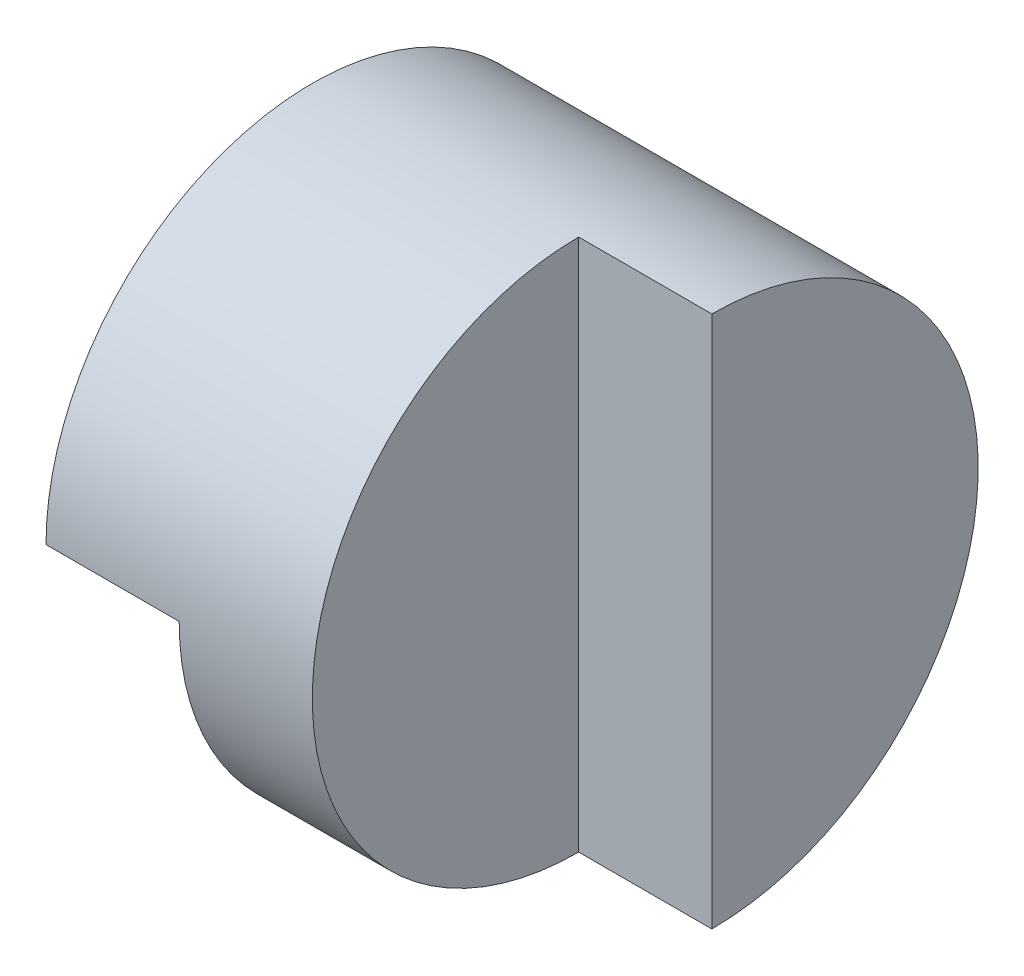
ISO-10303-21;
HEADER;
FILE_DESCRIPTION(('STEP AP214'),'2;1');
FILE_NAME('part.step','',(''),(''),'','','');
FILE_SCHEMA(('AUTOMOTIVE_DESIGN { 1 0 10303 214 1 1 1 1 }'));
ENDSEC;
DATA;
#1=APPLICATION_CONTEXT('core data for automotive mechanical design processes');
#2=APPLICATION_PROTOCOL_DEFINITION('international standard','automotive_design',2000,#1);
#3=PRODUCT_CONTEXT('',#1,'mechanical');
#4=PRODUCT('Part','Part','',(#3));
#5=PRODUCT_RELATED_PRODUCT_CATEGORY('part','',(#4));
#6=PRODUCT_DEFINITION_FORMATION('','',#4);
#7=PRODUCT_DEFINITION_CONTEXT('part definition',#1,'design');
#8=PRODUCT_DEFINITION('design','',#6,#7);
#9=PRODUCT_DEFINITION_SHAPE('','',#8);
#10=(LENGTH_UNIT() NAMED_UNIT(*) SI_UNIT(.MILLI.,.METRE.));
#11=(NAMED_UNIT(*) PLANE_ANGLE_UNIT() SI_UNIT($,.RADIAN.));
#12=(NAMED_UNIT(*) SI_UNIT($,.STERADIAN.) SOLID_ANGLE_UNIT());
#13=UNCERTAINTY_MEASURE_WITH_UNIT(LENGTH_MEASURE(1.E-05),#10,'distance_accuracy_value','');
#14=(GEOMETRIC_REPRESENTATION_CONTEXT(3) GLOBAL_UNCERTAINTY_ASSIGNED_CONTEXT((#13)) GLOBAL_UNIT_ASSIGNED_CONTEXT((#10,
#11,#12)) REPRESENTATION_CONTEXT('',''));
#15=CARTESIAN_POINT('',(0.,0.,0.));
#16=DIRECTION('',(0.,0.,1.));
#17=DIRECTION('',(1.,0.,0.));
#18=AXIS2_PLACEMENT_3D('',#15,#16,#17);
#19=CARTESIAN_POINT('',(40.,0.,40.));
#20=DIRECTION('',(-1.,0.,0.));
#21=DIRECTION('',(0.,0.,1.));
#22=AXIS2_PLACEMENT_3D('',#19,#20,#21);
#23=PLANE('',#22);
#24=CARTESIAN_POINT('',(40.,20.,20.));
#25=DIRECTION('',(-1.,0.,0.));
#26=DIRECTION('',(0.,0.,1.));
#27=AXIS2_PLACEMENT_3D('',#24,#25,#26);
#28=CIRCLE('',#27,20.);
#29=CARTESIAN_POINT('',(40.,40.,20.));
#30=VERTEX_POINT('',#29);
#31=CARTESIAN_POINT('',(40.,0.,20.));
#32=VERTEX_POINT('',#31);
#33=EDGE_CURVE('E142',#30,#32,#28,.T.);
#34=ORIENTED_EDGE('',*,*,#33,.F.);
#35=DIRECTION('',(0.,1.,0.));
#36=VECTOR('',#35,1.);
#37=CARTESIAN_POINT('',(40.,40.,20.));
#38=LINE('',#37,#36);
#39=EDGE_CURVE('E130',#32,#30,#38,.T.);
#40=ORIENTED_EDGE('',*,*,#39,.F.);
#41=EDGE_LOOP('',(#34,#40));
#42=FACE_BOUND('',#41,.T.);
#43=ADVANCED_FACE('F69',(#42),#23,.F.);
#44=CARTESIAN_POINT('',(10.,40.,0.));
#45=DIRECTION('',(1.,0.,0.));
#46=DIRECTION('',(0.,1.,0.));
#47=AXIS2_PLACEMENT_3D('',#44,#45,#46);
#48=PLANE('',#47);
#49=CARTESIAN_POINT('',(10.,20.,20.));
#50=DIRECTION('',(-1.,0.,0.));
#51=DIRECTION('',(0.,-1.,0.));
#52=AXIS2_PLACEMENT_3D('',#49,#50,#51);
#53=CIRCLE('',#52,20.);
#54=CARTESIAN_POINT('',(10.,20.,40.));
#55=VERTEX_POINT('',#54);
#56=CARTESIAN_POINT('',(10.,20.,0.));
#57=VERTEX_POINT('',#56);
#58=EDGE_CURVE('E168',#55,#57,#53,.T.);
#59=ORIENTED_EDGE('',*,*,#58,.T.);
#60=DIRECTION('',(0.,0.,1.));
#61=VECTOR('',#60,1.);
#62=CARTESIAN_POINT('',(10.,20.,0.));
#63=LINE('',#62,#61);
#64=CARTESIAN_POINT('',(10.,20.,20.));
#65=VERTEX_POINT('',#64);
#66=EDGE_CURVE('E12',#57,#65,#63,.T.);
#67=ORIENTED_EDGE('',*,*,#66,.T.);
#68=DIRECTION('',(0.,0.,1.));
#69=VECTOR('',#68,1.);
#70=CARTESIAN_POINT('',(10.,20.,0.));
#71=LINE('',#70,#69);
#72=EDGE_CURVE('E157',#65,#55,#71,.T.);
#73=ORIENTED_EDGE('',*,*,#72,.T.);
#74=EDGE_LOOP('',(#59,#67,#73));
#75=FACE_BOUND('',#74,.T.);
#76=ADVANCED_FACE('F192',(#75),#48,.F.);
#77=CARTESIAN_POINT('',(0.,0.,40.));
#78=DIRECTION('',(1.,0.,0.));
#79=DIRECTION('',(0.,0.,-1.));
#80=AXIS2_PLACEMENT_3D('',#77,#78,#79);
#81=PLANE('',#80);
#82=CARTESIAN_POINT('',(0.,20.,20.));
#83=DIRECTION('',(-1.,0.,0.));
#84=DIRECTION('',(0.,0.,1.));
#85=AXIS2_PLACEMENT_3D('',#82,#83,#84);
#86=CIRCLE('',#85,20.);
#87=CARTESIAN_POINT('',(0.,0.,20.));
#88=VERTEX_POINT('',#87);
#89=CARTESIAN_POINT('',(0.,20.,0.));
#90=VERTEX_POINT('',#89);
#91=EDGE_CURVE('E166',#88,#90,#86,.F.);
#92=ORIENTED_EDGE('',*,*,#91,.F.);
#93=DIRECTION('',(0.,-1.,0.));
#94=VECTOR('',#93,1.);
#95=CARTESIAN_POINT('',(0.,0.,20.));
#96=LINE('',#95,#94);
#97=CARTESIAN_POINT('',(0.,20.,20.));
#98=VERTEX_POINT('',#97);
#99=EDGE_CURVE('E144',#98,#88,#96,.T.);
#100=ORIENTED_EDGE('',*,*,#99,.F.);
#101=DIRECTION('',(0.,0.,1.));
#102=VECTOR('',#101,1.);
#103=CARTESIAN_POINT('',(0.,20.,0.));
#104=LINE('',#103,#102);
#105=EDGE_CURVE('E73',#90,#98,#104,.T.);
#106=ORIENTED_EDGE('',*,*,#105,.F.);
#107=EDGE_LOOP('',(#92,#100,#106));
#108=FACE_BOUND('',#107,.T.);
#109=ADVANCED_FACE('F71',(#108),#81,.F.);
#110=CARTESIAN_POINT('',(0.,20.,0.));
#111=DIRECTION('',(0.,-1.,0.));
#112=DIRECTION('',(0.,0.,-1.));
#113=AXIS2_PLACEMENT_3D('',#110,#111,#112);
#114=PLANE('',#113);
#115=ORIENTED_EDGE('',*,*,#105,.T.);
#116=DIRECTION('',(-1.,0.,0.));
#117=VECTOR('',#116,1.);
#118=CARTESIAN_POINT('',(20.,20.,20.));
#119=LINE('',#118,#117);
#120=EDGE_CURVE('E153',#65,#98,#119,.T.);
#121=ORIENTED_EDGE('',*,*,#120,.F.);
#122=ORIENTED_EDGE('',*,*,#66,.F.);
#123=DIRECTION('',(1.,0.,0.));
#124=VECTOR('',#123,1.);
#125=CARTESIAN_POINT('',(0.,20.,0.));
#126=LINE('',#125,#124);
#127=EDGE_CURVE('E172',#90,#57,#126,.T.);
#128=ORIENTED_EDGE('',*,*,#127,.F.);
#129=EDGE_LOOP('',(#115,#121,#122,#128));
#130=FACE_BOUND('',#129,.T.);
#131=ADVANCED_FACE('F179',(#130),#114,.F.);
#132=CARTESIAN_POINT('',(50.,20.,20.));
#133=DIRECTION('',(-1.,0.,0.));
#134=DIRECTION('',(0.,-1.,0.));
#135=AXIS2_PLACEMENT_3D('',#132,#133,#134);
#136=CYLINDRICAL_SURFACE('',#135,20.);
#137=DIRECTION('',(1.,0.,0.));
#138=VECTOR('',#137,1.);
#139=CARTESIAN_POINT('',(30.,0.,20.));
#140=LINE('',#139,#138);
#141=CARTESIAN_POINT('',(30.,0.,20.));
#142=VERTEX_POINT('',#141);
#143=EDGE_CURVE('E134',#142,#32,#140,.T.);
#144=ORIENTED_EDGE('',*,*,#143,.F.);
#145=CARTESIAN_POINT('',(30.,20.,20.));
#146=DIRECTION('',(1.,0.,0.));
#147=DIRECTION('',(0.,0.,-1.));
#148=AXIS2_PLACEMENT_3D('',#145,#146,#147);
#149=CIRCLE('',#148,20.);
#150=CARTESIAN_POINT('',(30.,40.,20.));
#151=VERTEX_POINT('',#150);
#152=EDGE_CURVE('E125',#151,#142,#149,.T.);
#153=ORIENTED_EDGE('',*,*,#152,.F.);
#154=DIRECTION('',(1.,0.,0.));
#155=VECTOR('',#154,1.);
#156=CARTESIAN_POINT('',(30.,40.,20.));
#157=LINE('',#156,#155);
#158=EDGE_CURVE('E136',#151,#30,#157,.T.);
#159=ORIENTED_EDGE('',*,*,#158,.T.);
#160=ORIENTED_EDGE('',*,*,#33,.T.);
#161=EDGE_LOOP('',(#144,#153,#159,#160));
#162=FACE_BOUND('',#161,.T.);
#163=DIRECTION('',(-1.,0.,0.));
#164=VECTOR('',#163,1.);
#165=CARTESIAN_POINT('',(20.,20.,40.));
#166=LINE('',#165,#164);
#167=CARTESIAN_POINT('',(20.,20.,40.));
#168=VERTEX_POINT('',#167);
#169=EDGE_CURVE('E155',#168,#55,#166,.T.);
#170=ORIENTED_EDGE('',*,*,#169,.F.);
#171=CARTESIAN_POINT('',(20.,20.,20.));
#172=DIRECTION('',(-1.,0.,0.));
#173=DIRECTION('',(0.,0.,-1.));
#174=AXIS2_PLACEMENT_3D('',#171,#172,#173);
#175=CIRCLE('',#174,20.);
#176=CARTESIAN_POINT('',(20.,0.,20.));
#177=VERTEX_POINT('',#176);
#178=EDGE_CURVE('E151',#177,#168,#175,.T.);
#179=ORIENTED_EDGE('',*,*,#178,.F.);
#180=DIRECTION('',(-1.,0.,0.));
#181=VECTOR('',#180,1.);
#182=CARTESIAN_POINT('',(20.,0.,20.));
#183=LINE('',#182,#181);
#184=EDGE_CURVE('E158',#177,#88,#183,.T.);
#185=ORIENTED_EDGE('',*,*,#184,.T.);
#186=ORIENTED_EDGE('',*,*,#91,.T.);
#187=ORIENTED_EDGE('',*,*,#127,.T.);
#188=ORIENTED_EDGE('',*,*,#58,.F.);
#189=EDGE_LOOP('',(#170,#179,#185,#186,#187,#188));
#190=FACE_BOUND('',#189,.T.);
#191=ADVANCED_FACE('F139',(#162,#190),#136,.T.);
#192=CARTESIAN_POINT('',(20.,20.,20.));
#193=DIRECTION('',(0.,1.,0.));
#194=DIRECTION('',(0.,0.,1.));
#195=AXIS2_PLACEMENT_3D('',#192,#193,#194);
#196=PLANE('',#195);
#197=CARTESIAN_POINT('',(20.,20.,20.));
#198=VERTEX_POINT('',#197);
#199=EDGE_CURVE('E161',#198,#65,#119,.T.);
#200=ORIENTED_EDGE('',*,*,#199,.F.);
#201=DIRECTION('',(0.,0.,-1.));
#202=VECTOR('',#201,1.);
#203=CARTESIAN_POINT('',(20.,20.,20.));
#204=LINE('',#203,#202);
#205=EDGE_CURVE('E148',#168,#198,#204,.T.);
#206=ORIENTED_EDGE('',*,*,#205,.F.);
#207=ORIENTED_EDGE('',*,*,#169,.T.);
#208=ORIENTED_EDGE('',*,*,#72,.F.);
#209=EDGE_LOOP('',(#200,#206,#207,#208));
#210=FACE_BOUND('',#209,.T.);
#211=ADVANCED_FACE('F190',(#210),#196,.F.);
#212=CARTESIAN_POINT('',(20.,0.,20.));
#213=DIRECTION('',(0.,0.,-1.));
#214=DIRECTION('',(-1.,0.,0.));
#215=AXIS2_PLACEMENT_3D('',#212,#213,#214);
#216=PLANE('',#215);
#217=ORIENTED_EDGE('',*,*,#99,.T.);
#218=ORIENTED_EDGE('',*,*,#184,.F.);
#219=DIRECTION('',(0.,-1.,0.));
#220=VECTOR('',#219,1.);
#221=CARTESIAN_POINT('',(20.,0.,20.));
#222=LINE('',#221,#220);
#223=EDGE_CURVE('E91',#198,#177,#222,.T.);
#224=ORIENTED_EDGE('',*,*,#223,.F.);
#225=ORIENTED_EDGE('',*,*,#199,.T.);
#226=ORIENTED_EDGE('',*,*,#120,.T.);
#227=EDGE_LOOP('',(#217,#218,#224,#225,#226));
#228=FACE_BOUND('',#227,.T.);
#229=ADVANCED_FACE('F185',(#228),#216,.F.);
#230=CARTESIAN_POINT('',(20.,20.,20.));
#231=DIRECTION('',(1.,0.,0.));
#232=DIRECTION('',(0.,0.,-1.));
#233=AXIS2_PLACEMENT_3D('',#230,#231,#232);
#234=PLANE('',#233);
#235=ORIENTED_EDGE('',*,*,#205,.T.);
#236=ORIENTED_EDGE('',*,*,#223,.T.);
#237=ORIENTED_EDGE('',*,*,#178,.T.);
#238=EDGE_LOOP('',(#235,#236,#237));
#239=FACE_BOUND('',#238,.T.);
#240=ADVANCED_FACE('F188',(#239),#234,.F.);
#241=CARTESIAN_POINT('',(30.,40.,20.));
#242=DIRECTION('',(0.,0.,-1.));
#243=DIRECTION('',(-1.,0.,0.));
#244=AXIS2_PLACEMENT_3D('',#241,#242,#243);
#245=PLANE('',#244);
#246=ORIENTED_EDGE('',*,*,#39,.T.);
#247=ORIENTED_EDGE('',*,*,#158,.F.);
#248=DIRECTION('',(0.,1.,0.));
#249=VECTOR('',#248,1.);
#250=CARTESIAN_POINT('',(30.,40.,20.));
#251=LINE('',#250,#249);
#252=EDGE_CURVE('E83',#142,#151,#251,.T.);
#253=ORIENTED_EDGE('',*,*,#252,.F.);
#254=ORIENTED_EDGE('',*,*,#143,.T.);
#255=EDGE_LOOP('',(#246,#247,#253,#254));
#256=FACE_BOUND('',#255,.T.);
#257=ADVANCED_FACE('F133',(#256),#245,.F.);
#258=CARTESIAN_POINT('',(30.,20.,20.));
#259=DIRECTION('',(1.,0.,0.));
#260=DIRECTION('',(0.,0.,-1.));
#261=AXIS2_PLACEMENT_3D('',#258,#259,#260);
#262=PLANE('',#261);
#263=ORIENTED_EDGE('',*,*,#152,.T.);
#264=ORIENTED_EDGE('',*,*,#252,.T.);
#265=EDGE_LOOP('',(#263,#264));
#266=FACE_BOUND('',#265,.T.);
#267=ADVANCED_FACE('F126',(#266),#262,.T.);
#268=CLOSED_SHELL('',(#43,#76,#109,#131,#191,#211,#229,#240,#257,#267));
#269=MANIFOLD_SOLID_BREP('B2',#268);
#270=ADVANCED_BREP_SHAPE_REPRESENTATION('',(#18,#269),#14);
#271=SHAPE_DEFINITION_REPRESENTATION(#9,#270);
ENDSEC;
END-ISO-10303-21;
